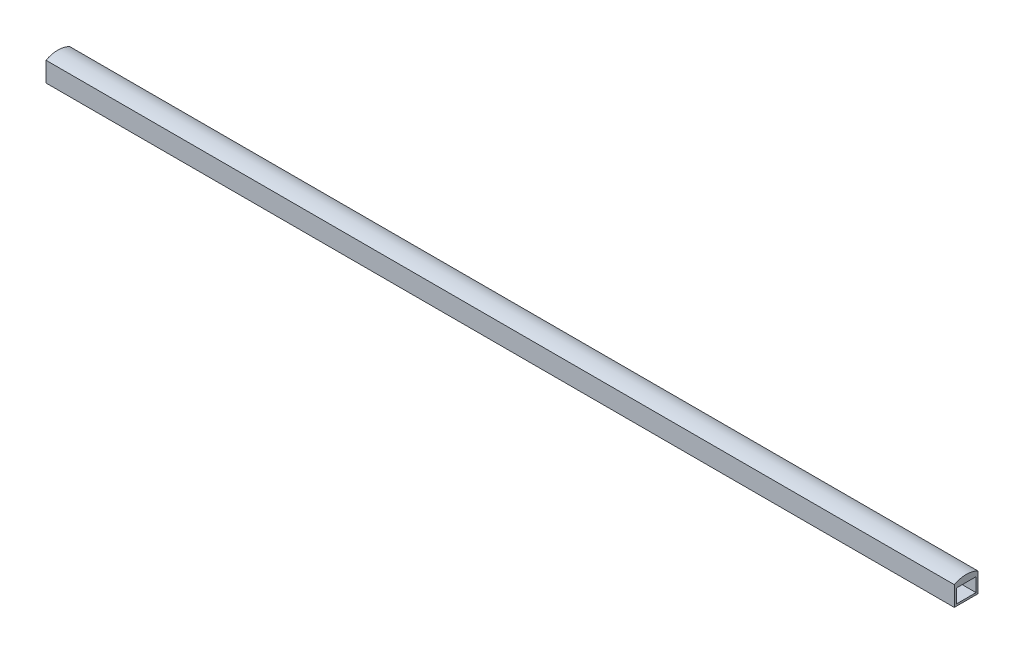
ISO-10303-21;
HEADER;
FILE_DESCRIPTION(('STEP AP214'),'2;1');
FILE_NAME('part.step','',(''),(''),'','','');
FILE_SCHEMA(('AUTOMOTIVE_DESIGN { 1 0 10303 214 1 1 1 1 }'));
ENDSEC;
DATA;
#1=APPLICATION_CONTEXT('core data for automotive mechanical design processes');
#2=APPLICATION_PROTOCOL_DEFINITION('international standard','automotive_design',2000,#1);
#3=PRODUCT_CONTEXT('',#1,'mechanical');
#4=PRODUCT('Part','Part','',(#3));
#5=PRODUCT_RELATED_PRODUCT_CATEGORY('part','',(#4));
#6=PRODUCT_DEFINITION_FORMATION('','',#4);
#7=PRODUCT_DEFINITION_CONTEXT('part definition',#1,'design');
#8=PRODUCT_DEFINITION('design','',#6,#7);
#9=PRODUCT_DEFINITION_SHAPE('','',#8);
#10=(LENGTH_UNIT() NAMED_UNIT(*) SI_UNIT(.MILLI.,.METRE.));
#11=(NAMED_UNIT(*) PLANE_ANGLE_UNIT() SI_UNIT($,.RADIAN.));
#12=(NAMED_UNIT(*) SI_UNIT($,.STERADIAN.) SOLID_ANGLE_UNIT());
#13=UNCERTAINTY_MEASURE_WITH_UNIT(LENGTH_MEASURE(1.E-05),#10,'distance_accuracy_value','');
#14=(GEOMETRIC_REPRESENTATION_CONTEXT(3) GLOBAL_UNCERTAINTY_ASSIGNED_CONTEXT((#13)) GLOBAL_UNIT_ASSIGNED_CONTEXT((#10,
#11,#12)) REPRESENTATION_CONTEXT('',''));
#15=CARTESIAN_POINT('',(0.,0.,0.));
#16=DIRECTION('',(0.,0.,1.));
#17=DIRECTION('',(1.,0.,0.));
#18=AXIS2_PLACEMENT_3D('',#15,#16,#17);
#19=CARTESIAN_POINT('',(460.,10.,0.));
#20=DIRECTION('',(0.,0.,-1.));
#21=DIRECTION('',(-1.,0.,0.));
#22=AXIS2_PLACEMENT_3D('',#19,#20,#21);
#23=PLANE('',#22);
#24=DIRECTION('',(1.,0.,0.));
#25=VECTOR('',#24,1.);
#26=CARTESIAN_POINT('',(460.,0.,0.));
#27=LINE('',#26,#25);
#28=CARTESIAN_POINT('',(0.,0.,0.));
#29=VERTEX_POINT('',#28);
#30=CARTESIAN_POINT('',(460.,0.,0.));
#31=VERTEX_POINT('',#30);
#32=EDGE_CURVE('E156',#29,#31,#27,.T.);
#33=ORIENTED_EDGE('',*,*,#32,.T.);
#34=DIRECTION('',(0.,-1.,0.));
#35=VECTOR('',#34,1.);
#36=CARTESIAN_POINT('',(460.,10.,0.));
#37=LINE('',#36,#35);
#38=CARTESIAN_POINT('',(460.,10.,0.));
#39=VERTEX_POINT('',#38);
#40=EDGE_CURVE('E11',#39,#31,#37,.T.);
#41=ORIENTED_EDGE('',*,*,#40,.F.);
#42=DIRECTION('',(1.,0.,0.));
#43=VECTOR('',#42,1.);
#44=CARTESIAN_POINT('',(460.,10.,0.));
#45=LINE('',#44,#43);
#46=CARTESIAN_POINT('',(0.,10.,0.));
#47=VERTEX_POINT('',#46);
#48=EDGE_CURVE('E102',#47,#39,#45,.T.);
#49=ORIENTED_EDGE('',*,*,#48,.F.);
#50=DIRECTION('',(0.,-1.,0.));
#51=VECTOR('',#50,1.);
#52=CARTESIAN_POINT('',(0.,10.,0.));
#53=LINE('',#52,#51);
#54=EDGE_CURVE('E105',#47,#29,#53,.T.);
#55=ORIENTED_EDGE('',*,*,#54,.T.);
#56=EDGE_LOOP('',(#33,#41,#49,#55));
#57=FACE_BOUND('',#56,.T.);
#58=ADVANCED_FACE('F37',(#57),#23,.F.);
#59=CARTESIAN_POINT('',(460.,10.,-12.));
#60=DIRECTION('',(-1.,0.,0.));
#61=DIRECTION('',(0.,0.,1.));
#62=AXIS2_PLACEMENT_3D('',#59,#60,#61);
#63=PLANE('',#62);
#64=DIRECTION('',(0.,-1.,0.));
#65=VECTOR('',#64,1.);
#66=CARTESIAN_POINT('',(460.,10.,-11.));
#67=LINE('',#66,#65);
#68=CARTESIAN_POINT('',(460.,8.,-11.));
#69=VERTEX_POINT('',#68);
#70=CARTESIAN_POINT('',(460.,0.999999999999998,-11.));
#71=VERTEX_POINT('',#70);
#72=EDGE_CURVE('E151',#69,#71,#67,.T.);
#73=ORIENTED_EDGE('',*,*,#72,.T.);
#74=DIRECTION('',(0.,0.,1.));
#75=VECTOR('',#74,1.);
#76=CARTESIAN_POINT('',(460.,0.999999999999997,-12.));
#77=LINE('',#76,#75);
#78=CARTESIAN_POINT('',(460.,1.,-1.));
#79=VERTEX_POINT('',#78);
#80=EDGE_CURVE('E154',#71,#79,#77,.T.);
#81=ORIENTED_EDGE('',*,*,#80,.T.);
#82=DIRECTION('',(0.,1.,0.));
#83=VECTOR('',#82,1.);
#84=CARTESIAN_POINT('',(460.,10.,-1.));
#85=LINE('',#84,#83);
#86=CARTESIAN_POINT('',(460.,8.,-1.));
#87=VERTEX_POINT('',#86);
#88=EDGE_CURVE('E141',#79,#87,#85,.T.);
#89=ORIENTED_EDGE('',*,*,#88,.T.);
#90=DIRECTION('',(0.,0.,-1.));
#91=VECTOR('',#90,1.);
#92=CARTESIAN_POINT('',(460.,8.,-12.));
#93=LINE('',#92,#91);
#94=EDGE_CURVE('E148',#87,#69,#93,.T.);
#95=ORIENTED_EDGE('',*,*,#94,.T.);
#96=EDGE_LOOP('',(#73,#81,#89,#95));
#97=FACE_BOUND('',#96,.T.);
#98=DIRECTION('',(0.,0.,-1.));
#99=VECTOR('',#98,1.);
#100=CARTESIAN_POINT('',(460.,0.,-12.));
#101=LINE('',#100,#99);
#102=CARTESIAN_POINT('',(460.,0.,-12.));
#103=VERTEX_POINT('',#102);
#104=EDGE_CURVE('E160',#31,#103,#101,.T.);
#105=ORIENTED_EDGE('',*,*,#104,.T.);
#106=DIRECTION('',(0.,-1.,0.));
#107=VECTOR('',#106,1.);
#108=CARTESIAN_POINT('',(460.,10.,-12.));
#109=LINE('',#108,#107);
#110=CARTESIAN_POINT('',(460.,10.,-12.));
#111=VERTEX_POINT('',#110);
#112=EDGE_CURVE('E44',#111,#103,#109,.T.);
#113=ORIENTED_EDGE('',*,*,#112,.F.);
#114=CARTESIAN_POINT('',(460.,-1.55328337154326,-6.));
#115=DIRECTION('',(-1.,0.,0.));
#116=DIRECTION('',(0.,0.,1.));
#117=AXIS2_PLACEMENT_3D('',#114,#115,#116);
#118=CIRCLE('',#117,13.0183853324127);
#119=EDGE_CURVE('E125',#39,#111,#118,.T.);
#120=ORIENTED_EDGE('',*,*,#119,.F.);
#121=ORIENTED_EDGE('',*,*,#40,.T.);
#122=EDGE_LOOP('',(#105,#113,#120,#121));
#123=FACE_BOUND('',#122,.T.);
#124=ADVANCED_FACE('F172',(#97,#123),#63,.F.);
#125=CARTESIAN_POINT('',(0.,10.,-12.));
#126=DIRECTION('',(0.,0.,1.));
#127=DIRECTION('',(1.,0.,0.));
#128=AXIS2_PLACEMENT_3D('',#125,#126,#127);
#129=PLANE('',#128);
#130=DIRECTION('',(-1.,0.,0.));
#131=VECTOR('',#130,1.);
#132=CARTESIAN_POINT('',(0.,0.,-12.));
#133=LINE('',#132,#131);
#134=CARTESIAN_POINT('',(0.,0.,-12.));
#135=VERTEX_POINT('',#134);
#136=EDGE_CURVE('E162',#103,#135,#133,.T.);
#137=ORIENTED_EDGE('',*,*,#136,.T.);
#138=DIRECTION('',(0.,-1.,0.));
#139=VECTOR('',#138,1.);
#140=CARTESIAN_POINT('',(0.,10.,-12.));
#141=LINE('',#140,#139);
#142=CARTESIAN_POINT('',(0.,10.,-12.));
#143=VERTEX_POINT('',#142);
#144=EDGE_CURVE('E120',#143,#135,#141,.T.);
#145=ORIENTED_EDGE('',*,*,#144,.F.);
#146=DIRECTION('',(-1.,0.,0.));
#147=VECTOR('',#146,1.);
#148=CARTESIAN_POINT('',(0.,10.,-12.));
#149=LINE('',#148,#147);
#150=EDGE_CURVE('E111',#111,#143,#149,.T.);
#151=ORIENTED_EDGE('',*,*,#150,.F.);
#152=ORIENTED_EDGE('',*,*,#112,.T.);
#153=EDGE_LOOP('',(#137,#145,#151,#152));
#154=FACE_BOUND('',#153,.T.);
#155=ADVANCED_FACE('F168',(#154),#129,.F.);
#156=CARTESIAN_POINT('',(0.,10.,0.));
#157=DIRECTION('',(1.,0.,0.));
#158=DIRECTION('',(0.,0.,-1.));
#159=AXIS2_PLACEMENT_3D('',#156,#157,#158);
#160=PLANE('',#159);
#161=DIRECTION('',(0.,1.,0.));
#162=VECTOR('',#161,1.);
#163=CARTESIAN_POINT('',(0.,1.,-1.));
#164=LINE('',#163,#162);
#165=CARTESIAN_POINT('',(0.,0.999999999999999,-1.));
#166=VERTEX_POINT('',#165);
#167=CARTESIAN_POINT('',(0.,8.,-1.));
#168=VERTEX_POINT('',#167);
#169=EDGE_CURVE('E130',#166,#168,#164,.T.);
#170=ORIENTED_EDGE('',*,*,#169,.F.);
#171=DIRECTION('',(0.,0.,1.));
#172=VECTOR('',#171,1.);
#173=CARTESIAN_POINT('',(0.,1.,-1.));
#174=LINE('',#173,#172);
#175=CARTESIAN_POINT('',(0.,0.999999999999998,-11.));
#176=VERTEX_POINT('',#175);
#177=EDGE_CURVE('E59',#176,#166,#174,.T.);
#178=ORIENTED_EDGE('',*,*,#177,.F.);
#179=DIRECTION('',(0.,-1.,0.));
#180=VECTOR('',#179,1.);
#181=CARTESIAN_POINT('',(0.,0.999999999999998,-11.));
#182=LINE('',#181,#180);
#183=CARTESIAN_POINT('',(0.,8.,-11.));
#184=VERTEX_POINT('',#183);
#185=EDGE_CURVE('E135',#184,#176,#182,.T.);
#186=ORIENTED_EDGE('',*,*,#185,.F.);
#187=DIRECTION('',(0.,0.,-1.));
#188=VECTOR('',#187,1.);
#189=CARTESIAN_POINT('',(0.,8.,-1.));
#190=LINE('',#189,#188);
#191=EDGE_CURVE('E132',#168,#184,#190,.T.);
#192=ORIENTED_EDGE('',*,*,#191,.F.);
#193=EDGE_LOOP('',(#170,#178,#186,#192));
#194=FACE_BOUND('',#193,.T.);
#195=DIRECTION('',(0.,0.,1.));
#196=VECTOR('',#195,1.);
#197=CARTESIAN_POINT('',(0.,0.,0.));
#198=LINE('',#197,#196);
#199=EDGE_CURVE('E112',#135,#29,#198,.T.);
#200=ORIENTED_EDGE('',*,*,#199,.T.);
#201=ORIENTED_EDGE('',*,*,#54,.F.);
#202=CARTESIAN_POINT('',(0.,-1.55328337154326,-6.));
#203=DIRECTION('',(-1.,0.,0.));
#204=DIRECTION('',(0.,0.,1.));
#205=AXIS2_PLACEMENT_3D('',#202,#203,#204);
#206=CIRCLE('',#205,13.0183853324127);
#207=EDGE_CURVE('E118',#47,#143,#206,.T.);
#208=ORIENTED_EDGE('',*,*,#207,.T.);
#209=ORIENTED_EDGE('',*,*,#144,.T.);
#210=EDGE_LOOP('',(#200,#201,#208,#209));
#211=FACE_BOUND('',#210,.T.);
#212=ADVANCED_FACE('F116',(#194,#211),#160,.F.);
#213=CARTESIAN_POINT('',(0.,0.,0.));
#214=DIRECTION('',(0.,-1.,0.));
#215=DIRECTION('',(0.,0.,-1.));
#216=AXIS2_PLACEMENT_3D('',#213,#214,#215);
#217=PLANE('',#216);
#218=ORIENTED_EDGE('',*,*,#32,.F.);
#219=ORIENTED_EDGE('',*,*,#199,.F.);
#220=ORIENTED_EDGE('',*,*,#136,.F.);
#221=ORIENTED_EDGE('',*,*,#104,.F.);
#222=EDGE_LOOP('',(#218,#219,#220,#221));
#223=FACE_BOUND('',#222,.T.);
#224=ADVANCED_FACE('F171',(#223),#217,.T.);
#225=CARTESIAN_POINT('',(970.000000000001,1.,-1.));
#226=DIRECTION('',(0.,-1.,0.));
#227=DIRECTION('',(0.,0.,-1.));
#228=AXIS2_PLACEMENT_3D('',#225,#226,#227);
#229=PLANE('',#228);
#230=DIRECTION('',(-1.,0.,0.));
#231=VECTOR('',#230,1.);
#232=CARTESIAN_POINT('',(970.000000000001,0.999999999999998,-11.));
#233=LINE('',#232,#231);
#234=EDGE_CURVE('E139',#71,#176,#233,.T.);
#235=ORIENTED_EDGE('',*,*,#234,.T.);
#236=ORIENTED_EDGE('',*,*,#177,.T.);
#237=DIRECTION('',(-1.,0.,0.));
#238=VECTOR('',#237,1.);
#239=CARTESIAN_POINT('',(970.000000000001,1.,-1.));
#240=LINE('',#239,#238);
#241=EDGE_CURVE('E138',#79,#166,#240,.T.);
#242=ORIENTED_EDGE('',*,*,#241,.F.);
#243=ORIENTED_EDGE('',*,*,#80,.F.);
#244=EDGE_LOOP('',(#235,#236,#242,#243));
#245=FACE_BOUND('',#244,.T.);
#246=ADVANCED_FACE('F186',(#245),#229,.F.);
#247=CARTESIAN_POINT('',(970.000000000001,0.999999999999998,-11.));
#248=DIRECTION('',(0.,0.,-1.));
#249=DIRECTION('',(0.,1.,0.));
#250=AXIS2_PLACEMENT_3D('',#247,#248,#249);
#251=PLANE('',#250);
#252=DIRECTION('',(-1.,0.,0.));
#253=VECTOR('',#252,1.);
#254=CARTESIAN_POINT('',(970.000000000001,8.,-11.));
#255=LINE('',#254,#253);
#256=EDGE_CURVE('E142',#69,#184,#255,.T.);
#257=ORIENTED_EDGE('',*,*,#256,.T.);
#258=ORIENTED_EDGE('',*,*,#185,.T.);
#259=ORIENTED_EDGE('',*,*,#234,.F.);
#260=ORIENTED_EDGE('',*,*,#72,.F.);
#261=EDGE_LOOP('',(#257,#258,#259,#260));
#262=FACE_BOUND('',#261,.T.);
#263=ADVANCED_FACE('F189',(#262),#251,.F.);
#264=CARTESIAN_POINT('',(970.000000000001,8.,-1.));
#265=DIRECTION('',(0.,1.,0.));
#266=DIRECTION('',(0.,0.,1.));
#267=AXIS2_PLACEMENT_3D('',#264,#265,#266);
#268=PLANE('',#267);
#269=DIRECTION('',(-1.,0.,0.));
#270=VECTOR('',#269,1.);
#271=CARTESIAN_POINT('',(970.000000000001,8.,-1.));
#272=LINE('',#271,#270);
#273=EDGE_CURVE('E51',#87,#168,#272,.T.);
#274=ORIENTED_EDGE('',*,*,#273,.T.);
#275=ORIENTED_EDGE('',*,*,#191,.T.);
#276=ORIENTED_EDGE('',*,*,#256,.F.);
#277=ORIENTED_EDGE('',*,*,#94,.F.);
#278=EDGE_LOOP('',(#274,#275,#276,#277));
#279=FACE_BOUND('',#278,.T.);
#280=ADVANCED_FACE('F193',(#279),#268,.F.);
#281=CARTESIAN_POINT('',(970.000000000001,1.,-1.));
#282=DIRECTION('',(0.,0.,1.));
#283=DIRECTION('',(0.,-1.,0.));
#284=AXIS2_PLACEMENT_3D('',#281,#282,#283);
#285=PLANE('',#284);
#286=ORIENTED_EDGE('',*,*,#241,.T.);
#287=ORIENTED_EDGE('',*,*,#169,.T.);
#288=ORIENTED_EDGE('',*,*,#273,.F.);
#289=ORIENTED_EDGE('',*,*,#88,.F.);
#290=EDGE_LOOP('',(#286,#287,#288,#289));
#291=FACE_BOUND('',#290,.T.);
#292=ADVANCED_FACE('F190',(#291),#285,.F.);
#293=CARTESIAN_POINT('',(460.,-1.55328337154326,-6.));
#294=DIRECTION('',(-1.,0.,0.));
#295=DIRECTION('',(0.,0.,1.));
#296=AXIS2_PLACEMENT_3D('',#293,#294,#295);
#297=CYLINDRICAL_SURFACE('',#296,13.0183853324127);
#298=ORIENTED_EDGE('',*,*,#207,.F.);
#299=ORIENTED_EDGE('',*,*,#48,.T.);
#300=ORIENTED_EDGE('',*,*,#119,.T.);
#301=ORIENTED_EDGE('',*,*,#150,.T.);
#302=EDGE_LOOP('',(#298,#299,#300,#301));
#303=FACE_BOUND('',#302,.T.);
#304=ADVANCED_FACE('F123',(#303),#297,.T.);
#305=CLOSED_SHELL('',(#58,#124,#155,#212,#224,#246,#263,#280,#292,#304));
#306=MANIFOLD_SOLID_BREP('B2',#305);
#307=ADVANCED_BREP_SHAPE_REPRESENTATION('',(#18,#306),#14);
#308=SHAPE_DEFINITION_REPRESENTATION(#9,#307);
ENDSEC;
END-ISO-10303-21;
